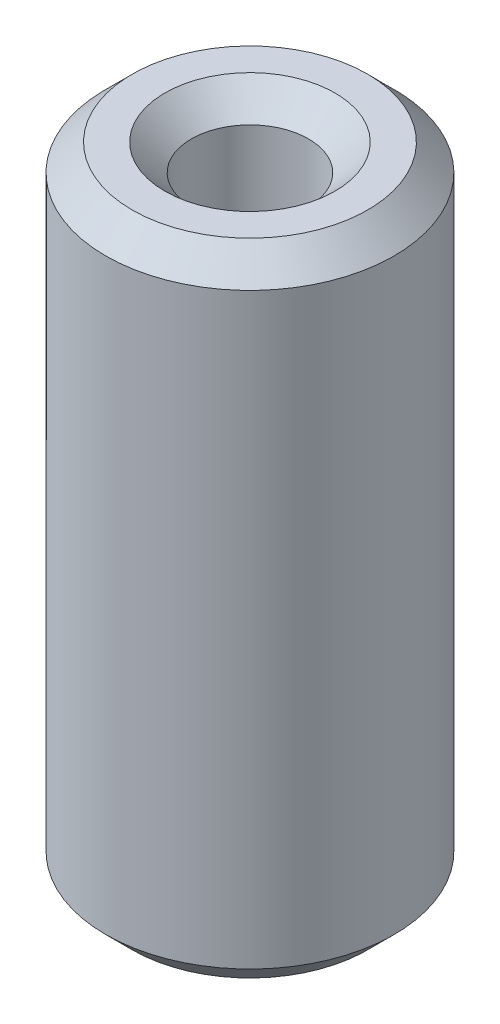
ISO-10303-21;
HEADER;
FILE_DESCRIPTION(('STEP AP214'),'2;1');
FILE_NAME('part.step','',(''),(''),'','','');
FILE_SCHEMA(('AUTOMOTIVE_DESIGN { 1 0 10303 214 1 1 1 1 }'));
ENDSEC;
DATA;
#1=APPLICATION_CONTEXT('core data for automotive mechanical design processes');
#2=APPLICATION_PROTOCOL_DEFINITION('international standard','automotive_design',2000,#1);
#3=PRODUCT_CONTEXT('',#1,'mechanical');
#4=PRODUCT('Part','Part','',(#3));
#5=PRODUCT_RELATED_PRODUCT_CATEGORY('part','',(#4));
#6=PRODUCT_DEFINITION_FORMATION('','',#4);
#7=PRODUCT_DEFINITION_CONTEXT('part definition',#1,'design');
#8=PRODUCT_DEFINITION('design','',#6,#7);
#9=PRODUCT_DEFINITION_SHAPE('','',#8);
#10=(LENGTH_UNIT() NAMED_UNIT(*) SI_UNIT(.MILLI.,.METRE.));
#11=(NAMED_UNIT(*) PLANE_ANGLE_UNIT() SI_UNIT($,.RADIAN.));
#12=(NAMED_UNIT(*) SI_UNIT($,.STERADIAN.) SOLID_ANGLE_UNIT());
#13=UNCERTAINTY_MEASURE_WITH_UNIT(LENGTH_MEASURE(1.E-05),#10,'distance_accuracy_value','');
#14=(GEOMETRIC_REPRESENTATION_CONTEXT(3) GLOBAL_UNCERTAINTY_ASSIGNED_CONTEXT((#13)) GLOBAL_UNIT_ASSIGNED_CONTEXT((#10,
#11,#12)) REPRESENTATION_CONTEXT('',''));
#15=CARTESIAN_POINT('',(0.,0.,0.));
#16=DIRECTION('',(0.,0.,1.));
#17=DIRECTION('',(1.,0.,0.));
#18=AXIS2_PLACEMENT_3D('',#15,#16,#17);
#19=CARTESIAN_POINT('',(0.,88.8598813159815,0.));
#20=DIRECTION('',(0.,-1.,0.));
#21=DIRECTION('',(0.,0.,-1.));
#22=AXIS2_PLACEMENT_3D('',#19,#20,#21);
#23=CYLINDRICAL_SURFACE('',#22,20.);
#24=CARTESIAN_POINT('',(0.,3.67584975311415,0.));
#25=DIRECTION('',(0.,1.,0.));
#26=DIRECTION('',(0.,0.,1.));
#27=AXIS2_PLACEMENT_3D('',#24,#25,#26);
#28=CIRCLE('',#27,20.);
#29=CARTESIAN_POINT('',(0.,3.67584975311415,20.));
#30=VERTEX_POINT('',#29);
#31=EDGE_CURVE('E10',#30,#30,#28,.T.);
#32=ORIENTED_EDGE('',*,*,#31,.T.);
#33=EDGE_LOOP('',(#32));
#34=FACE_BOUND('',#33,.T.);
#35=CARTESIAN_POINT('',(0.,85.1840315628674,0.));
#36=DIRECTION('',(0.,1.,0.));
#37=DIRECTION('',(0.,0.,1.));
#38=AXIS2_PLACEMENT_3D('',#35,#36,#37);
#39=CIRCLE('',#38,20.);
#40=CARTESIAN_POINT('',(0.,85.1840315628674,20.));
#41=VERTEX_POINT('',#40);
#42=EDGE_CURVE('E50',#41,#41,#39,.F.);
#43=ORIENTED_EDGE('',*,*,#42,.T.);
#44=EDGE_LOOP('',(#43));
#45=FACE_BOUND('',#44,.T.);
#46=ADVANCED_FACE('F39',(#34,#45),#23,.T.);
#47=CARTESIAN_POINT('',(0.,88.8598813159815,0.));
#48=DIRECTION('',(0.,1.,0.));
#49=DIRECTION('',(0.,0.,1.));
#50=AXIS2_PLACEMENT_3D('',#47,#48,#49);
#51=PLANE('',#50);
#52=CARTESIAN_POINT('',(0.,88.8598813159815,0.));
#53=DIRECTION('',(0.,1.,0.));
#54=DIRECTION('',(0.,0.,1.));
#55=AXIS2_PLACEMENT_3D('',#52,#53,#54);
#56=CIRCLE('',#55,11.800150117492);
#57=CARTESIAN_POINT('',(0.,88.8598813159815,11.800150117492));
#58=VERTEX_POINT('',#57);
#59=EDGE_CURVE('E58',#58,#58,#56,.F.);
#60=ORIENTED_EDGE('',*,*,#59,.T.);
#61=EDGE_LOOP('',(#60));
#62=FACE_BOUND('',#61,.T.);
#63=CARTESIAN_POINT('',(0.,88.8598813159815,0.));
#64=DIRECTION('',(0.,1.,0.));
#65=DIRECTION('',(0.,0.,1.));
#66=AXIS2_PLACEMENT_3D('',#63,#64,#65);
#67=CIRCLE('',#66,16.3241502468858);
#68=CARTESIAN_POINT('',(0.,88.8598813159815,16.3241502468858));
#69=VERTEX_POINT('',#68);
#70=EDGE_CURVE('E61',#69,#69,#67,.T.);
#71=ORIENTED_EDGE('',*,*,#70,.T.);
#72=EDGE_LOOP('',(#71));
#73=FACE_BOUND('',#72,.T.);
#74=ADVANCED_FACE('F88',(#62,#73),#51,.T.);
#75=CARTESIAN_POINT('',(0.,0.,0.));
#76=DIRECTION('',(0.,1.,0.));
#77=DIRECTION('',(0.,0.,1.));
#78=AXIS2_PLACEMENT_3D('',#75,#76,#77);
#79=PLANE('',#78);
#80=CARTESIAN_POINT('',(0.,0.,0.));
#81=DIRECTION('',(0.,1.,0.));
#82=DIRECTION('',(0.,0.,1.));
#83=AXIS2_PLACEMENT_3D('',#80,#81,#82);
#84=CIRCLE('',#83,11.800150117492);
#85=CARTESIAN_POINT('',(0.,0.,11.800150117492));
#86=VERTEX_POINT('',#85);
#87=EDGE_CURVE('E51',#86,#86,#84,.T.);
#88=ORIENTED_EDGE('',*,*,#87,.T.);
#89=EDGE_LOOP('',(#88));
#90=FACE_BOUND('',#89,.T.);
#91=CARTESIAN_POINT('',(0.,0.,0.));
#92=DIRECTION('',(0.,1.,0.));
#93=DIRECTION('',(0.,0.,1.));
#94=AXIS2_PLACEMENT_3D('',#91,#92,#93);
#95=CIRCLE('',#94,16.3241502468858);
#96=CARTESIAN_POINT('',(0.,0.,16.3241502468858));
#97=VERTEX_POINT('',#96);
#98=EDGE_CURVE('E54',#97,#97,#95,.F.);
#99=ORIENTED_EDGE('',*,*,#98,.T.);
#100=EDGE_LOOP('',(#99));
#101=FACE_BOUND('',#100,.T.);
#102=ADVANCED_FACE('F83',(#90,#101),#79,.F.);
#103=CARTESIAN_POINT('',(0.,88.8598813159815,0.));
#104=DIRECTION('',(0.,-1.,0.));
#105=DIRECTION('',(0.,0.,-1.));
#106=AXIS2_PLACEMENT_3D('',#103,#104,#105);
#107=CYLINDRICAL_SURFACE('',#106,8.12430036437786);
#108=CARTESIAN_POINT('',(0.,85.1840315628674,0.));
#109=DIRECTION('',(0.,1.,0.));
#110=DIRECTION('',(0.,0.,1.));
#111=AXIS2_PLACEMENT_3D('',#108,#109,#110);
#112=CIRCLE('',#111,8.12430036437786);
#113=CARTESIAN_POINT('',(0.,85.1840315628674,8.12430036437786));
#114=VERTEX_POINT('',#113);
#115=EDGE_CURVE('E67',#114,#114,#112,.T.);
#116=ORIENTED_EDGE('',*,*,#115,.T.);
#117=EDGE_LOOP('',(#116));
#118=FACE_BOUND('',#117,.T.);
#119=CARTESIAN_POINT('',(0.,3.67584975311418,0.));
#120=DIRECTION('',(0.,1.,0.));
#121=DIRECTION('',(0.,0.,1.));
#122=AXIS2_PLACEMENT_3D('',#119,#120,#121);
#123=CIRCLE('',#122,8.12430036437786);
#124=CARTESIAN_POINT('',(0.,3.67584975311418,8.12430036437786));
#125=VERTEX_POINT('',#124);
#126=EDGE_CURVE('E69',#125,#125,#123,.F.);
#127=ORIENTED_EDGE('',*,*,#126,.T.);
#128=EDGE_LOOP('',(#127));
#129=FACE_BOUND('',#128,.T.);
#130=ADVANCED_FACE('F71',(#118,#129),#107,.F.);
#131=CARTESIAN_POINT('',(0.,85.1840315628674,0.));
#132=DIRECTION('',(0.,1.,0.));
#133=DIRECTION('',(0.,0.,1.));
#134=AXIS2_PLACEMENT_3D('',#131,#132,#133);
#135=CONICAL_SURFACE('',#134,8.12430036437786,0.785398163397451);
#136=ORIENTED_EDGE('',*,*,#59,.F.);
#137=EDGE_LOOP('',(#136));
#138=FACE_BOUND('',#137,.T.);
#139=ORIENTED_EDGE('',*,*,#115,.F.);
#140=EDGE_LOOP('',(#139));
#141=FACE_BOUND('',#140,.T.);
#142=ADVANCED_FACE('F77',(#138,#141),#135,.F.);
#143=CARTESIAN_POINT('',(0.,0.,0.));
#144=DIRECTION('',(0.,-1.,0.));
#145=DIRECTION('',(0.,0.,-1.));
#146=AXIS2_PLACEMENT_3D('',#143,#144,#145);
#147=CONICAL_SURFACE('',#146,11.800150117492,0.785398163397446);
#148=ORIENTED_EDGE('',*,*,#126,.F.);
#149=EDGE_LOOP('',(#148));
#150=FACE_BOUND('',#149,.T.);
#151=ORIENTED_EDGE('',*,*,#87,.F.);
#152=EDGE_LOOP('',(#151));
#153=FACE_BOUND('',#152,.T.);
#154=ADVANCED_FACE('F73',(#150,#153),#147,.F.);
#155=CARTESIAN_POINT('',(0.,3.67584975311415,0.));
#156=DIRECTION('',(0.,1.,0.));
#157=DIRECTION('',(0.,0.,1.));
#158=AXIS2_PLACEMENT_3D('',#155,#156,#157);
#159=CONICAL_SURFACE('',#158,20.,0.785398163397452);
#160=ORIENTED_EDGE('',*,*,#98,.F.);
#161=EDGE_LOOP('',(#160));
#162=FACE_BOUND('',#161,.T.);
#163=ORIENTED_EDGE('',*,*,#31,.F.);
#164=EDGE_LOOP('',(#163));
#165=FACE_BOUND('',#164,.T.);
#166=ADVANCED_FACE('F76',(#162,#165),#159,.T.);
#167=CARTESIAN_POINT('',(0.,88.8598813159815,0.));
#168=DIRECTION('',(0.,-1.,0.));
#169=DIRECTION('',(0.,0.,-1.));
#170=AXIS2_PLACEMENT_3D('',#167,#168,#169);
#171=CONICAL_SURFACE('',#170,16.3241502468858,0.785398163397448);
#172=ORIENTED_EDGE('',*,*,#42,.F.);
#173=EDGE_LOOP('',(#172));
#174=FACE_BOUND('',#173,.T.);
#175=ORIENTED_EDGE('',*,*,#70,.F.);
#176=EDGE_LOOP('',(#175));
#177=FACE_BOUND('',#176,.T.);
#178=ADVANCED_FACE('F45',(#174,#177),#171,.T.);
#179=CLOSED_SHELL('',(#46,#74,#102,#130,#142,#154,#166,#178));
#180=MANIFOLD_SOLID_BREP('B2',#179);
#181=ADVANCED_BREP_SHAPE_REPRESENTATION('',(#18,#180),#14);
#182=SHAPE_DEFINITION_REPRESENTATION(#9,#181);
ENDSEC;
END-ISO-10303-21;
